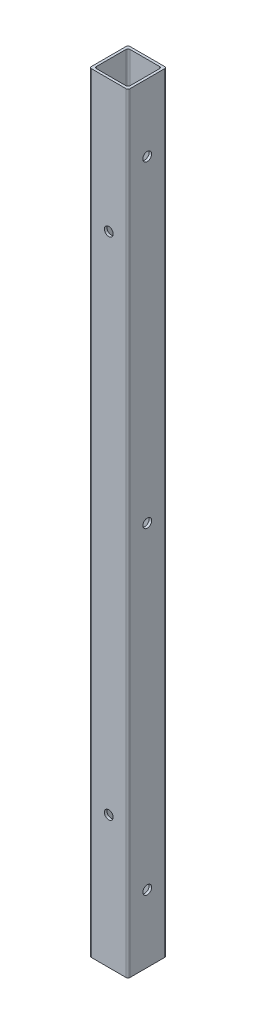
ISO-10303-21;
HEADER;
FILE_DESCRIPTION(('STEP AP214'),'2;1');
FILE_NAME('part.step','',(''),(''),'','','');
FILE_SCHEMA(('AUTOMOTIVE_DESIGN { 1 0 10303 214 1 1 1 1 }'));
ENDSEC;
DATA;
#1=APPLICATION_CONTEXT('core data for automotive mechanical design processes');
#2=APPLICATION_PROTOCOL_DEFINITION('international standard','automotive_design',2000,#1);
#3=PRODUCT_CONTEXT('',#1,'mechanical');
#4=PRODUCT('Part','Part','',(#3));
#5=PRODUCT_RELATED_PRODUCT_CATEGORY('part','',(#4));
#6=PRODUCT_DEFINITION_FORMATION('','',#4);
#7=PRODUCT_DEFINITION_CONTEXT('part definition',#1,'design');
#8=PRODUCT_DEFINITION('design','',#6,#7);
#9=PRODUCT_DEFINITION_SHAPE('','',#8);
#10=(LENGTH_UNIT() NAMED_UNIT(*) SI_UNIT(.MILLI.,.METRE.));
#11=(NAMED_UNIT(*) PLANE_ANGLE_UNIT() SI_UNIT($,.RADIAN.));
#12=(NAMED_UNIT(*) SI_UNIT($,.STERADIAN.) SOLID_ANGLE_UNIT());
#13=UNCERTAINTY_MEASURE_WITH_UNIT(LENGTH_MEASURE(1.E-05),#10,'distance_accuracy_value','');
#14=(GEOMETRIC_REPRESENTATION_CONTEXT(3) GLOBAL_UNCERTAINTY_ASSIGNED_CONTEXT((#13)) GLOBAL_UNIT_ASSIGNED_CONTEXT((#10,
#11,#12)) REPRESENTATION_CONTEXT('',''));
#15=CARTESIAN_POINT('',(0.,0.,0.));
#16=DIRECTION('',(0.,0.,1.));
#17=DIRECTION('',(1.,0.,0.));
#18=AXIS2_PLACEMENT_3D('',#15,#16,#17);
#19=CARTESIAN_POINT('',(0.,508.,0.));
#20=DIRECTION('',(0.,-1.,0.));
#21=DIRECTION('',(0.,0.,-1.));
#22=AXIS2_PLACEMENT_3D('',#19,#20,#21);
#23=PLANE('',#22);
#24=DIRECTION('',(0.,0.,1.));
#25=VECTOR('',#24,1.);
#26=CARTESIAN_POINT('',(-12.7,508.,12.7));
#27=LINE('',#26,#25);
#28=CARTESIAN_POINT('',(-12.7,508.,-11.43));
#29=VERTEX_POINT('',#28);
#30=CARTESIAN_POINT('',(-12.7,508.,11.43));
#31=VERTEX_POINT('',#30);
#32=EDGE_CURVE('E180',#29,#31,#27,.T.);
#33=ORIENTED_EDGE('',*,*,#32,.T.);
#34=CARTESIAN_POINT('',(-11.43,508.,11.43));
#35=DIRECTION('',(0.,-1.,0.));
#36=DIRECTION('',(0.,0.,-1.));
#37=AXIS2_PLACEMENT_3D('',#34,#35,#36);
#38=CIRCLE('',#37,1.27);
#39=CARTESIAN_POINT('',(-11.43,508.,12.7));
#40=VERTEX_POINT('',#39);
#41=EDGE_CURVE('E222',#31,#40,#38,.F.);
#42=ORIENTED_EDGE('',*,*,#41,.T.);
#43=DIRECTION('',(1.,0.,0.));
#44=VECTOR('',#43,1.);
#45=CARTESIAN_POINT('',(-12.7,508.,12.7));
#46=LINE('',#45,#44);
#47=CARTESIAN_POINT('',(11.43,508.,12.7));
#48=VERTEX_POINT('',#47);
#49=EDGE_CURVE('E175',#40,#48,#46,.T.);
#50=ORIENTED_EDGE('',*,*,#49,.T.);
#51=CARTESIAN_POINT('',(11.43,508.,11.43));
#52=DIRECTION('',(0.,-1.,0.));
#53=DIRECTION('',(0.,0.,-1.));
#54=AXIS2_PLACEMENT_3D('',#51,#52,#53);
#55=CIRCLE('',#54,1.27);
#56=CARTESIAN_POINT('',(12.7,508.,11.43));
#57=VERTEX_POINT('',#56);
#58=EDGE_CURVE('E217',#48,#57,#55,.F.);
#59=ORIENTED_EDGE('',*,*,#58,.T.);
#60=DIRECTION('',(0.,0.,-1.));
#61=VECTOR('',#60,1.);
#62=CARTESIAN_POINT('',(12.7,508.,12.7));
#63=LINE('',#62,#61);
#64=CARTESIAN_POINT('',(12.7,508.,-11.43));
#65=VERTEX_POINT('',#64);
#66=EDGE_CURVE('E301',#57,#65,#63,.T.);
#67=ORIENTED_EDGE('',*,*,#66,.T.);
#68=CARTESIAN_POINT('',(11.43,508.,-11.43));
#69=DIRECTION('',(0.,-1.,0.));
#70=DIRECTION('',(0.,0.,-1.));
#71=AXIS2_PLACEMENT_3D('',#68,#69,#70);
#72=CIRCLE('',#71,1.27);
#73=CARTESIAN_POINT('',(11.43,508.,-12.7));
#74=VERTEX_POINT('',#73);
#75=EDGE_CURVE('E58',#65,#74,#72,.F.);
#76=ORIENTED_EDGE('',*,*,#75,.T.);
#77=DIRECTION('',(-1.,0.,0.));
#78=VECTOR('',#77,1.);
#79=CARTESIAN_POINT('',(-12.7,508.,-12.7));
#80=LINE('',#79,#78);
#81=CARTESIAN_POINT('',(-11.43,508.,-12.7));
#82=VERTEX_POINT('',#81);
#83=EDGE_CURVE('E303',#74,#82,#80,.T.);
#84=ORIENTED_EDGE('',*,*,#83,.T.);
#85=CARTESIAN_POINT('',(-11.43,508.,-11.43));
#86=DIRECTION('',(0.,-1.,0.));
#87=DIRECTION('',(0.,0.,-1.));
#88=AXIS2_PLACEMENT_3D('',#85,#86,#87);
#89=CIRCLE('',#88,1.27);
#90=EDGE_CURVE('E220',#82,#29,#89,.F.);
#91=ORIENTED_EDGE('',*,*,#90,.T.);
#92=EDGE_LOOP('',(#33,#42,#50,#59,#67,#76,#84,#91));
#93=FACE_BOUND('',#92,.T.);
#94=DIRECTION('',(1.,0.,0.));
#95=VECTOR('',#94,1.);
#96=CARTESIAN_POINT('',(-11.049,508.,11.049));
#97=LINE('',#96,#95);
#98=CARTESIAN_POINT('',(-9.779,508.,11.049));
#99=VERTEX_POINT('',#98);
#100=CARTESIAN_POINT('',(9.779,508.,11.049));
#101=VERTEX_POINT('',#100);
#102=EDGE_CURVE('E284',#99,#101,#97,.T.);
#103=ORIENTED_EDGE('',*,*,#102,.F.);
#104=CARTESIAN_POINT('',(-9.779,508.,9.779));
#105=DIRECTION('',(0.,-1.,0.));
#106=DIRECTION('',(0.,0.,-1.));
#107=AXIS2_PLACEMENT_3D('',#104,#105,#106);
#108=CIRCLE('',#107,1.27);
#109=CARTESIAN_POINT('',(-11.049,508.,9.779));
#110=VERTEX_POINT('',#109);
#111=EDGE_CURVE('E11',#99,#110,#108,.T.);
#112=ORIENTED_EDGE('',*,*,#111,.T.);
#113=DIRECTION('',(0.,0.,1.));
#114=VECTOR('',#113,1.);
#115=CARTESIAN_POINT('',(-11.049,508.,11.049));
#116=LINE('',#115,#114);
#117=CARTESIAN_POINT('',(-11.049,508.,-9.779));
#118=VERTEX_POINT('',#117);
#119=EDGE_CURVE('E292',#118,#110,#116,.T.);
#120=ORIENTED_EDGE('',*,*,#119,.F.);
#121=CARTESIAN_POINT('',(-9.779,508.,-9.779));
#122=DIRECTION('',(0.,-1.,0.));
#123=DIRECTION('',(0.,0.,-1.));
#124=AXIS2_PLACEMENT_3D('',#121,#122,#123);
#125=CIRCLE('',#124,1.27);
#126=CARTESIAN_POINT('',(-9.779,508.,-11.049));
#127=VERTEX_POINT('',#126);
#128=EDGE_CURVE('E235',#118,#127,#125,.T.);
#129=ORIENTED_EDGE('',*,*,#128,.T.);
#130=DIRECTION('',(-1.,0.,0.));
#131=VECTOR('',#130,1.);
#132=CARTESIAN_POINT('',(-11.049,508.,-11.049));
#133=LINE('',#132,#131);
#134=CARTESIAN_POINT('',(9.779,508.,-11.049));
#135=VERTEX_POINT('',#134);
#136=EDGE_CURVE('E290',#135,#127,#133,.T.);
#137=ORIENTED_EDGE('',*,*,#136,.F.);
#138=CARTESIAN_POINT('',(9.779,508.,-9.779));
#139=DIRECTION('',(0.,-1.,0.));
#140=DIRECTION('',(0.,0.,-1.));
#141=AXIS2_PLACEMENT_3D('',#138,#139,#140);
#142=CIRCLE('',#141,1.27);
#143=CARTESIAN_POINT('',(11.049,508.,-9.779));
#144=VERTEX_POINT('',#143);
#145=EDGE_CURVE('E160',#135,#144,#142,.T.);
#146=ORIENTED_EDGE('',*,*,#145,.T.);
#147=DIRECTION('',(0.,0.,-1.));
#148=VECTOR('',#147,1.);
#149=CARTESIAN_POINT('',(11.049,508.,11.049));
#150=LINE('',#149,#148);
#151=CARTESIAN_POINT('',(11.049,508.,9.779));
#152=VERTEX_POINT('',#151);
#153=EDGE_CURVE('E287',#152,#144,#150,.T.);
#154=ORIENTED_EDGE('',*,*,#153,.F.);
#155=CARTESIAN_POINT('',(9.779,508.,9.779));
#156=DIRECTION('',(0.,-1.,0.));
#157=DIRECTION('',(0.,0.,-1.));
#158=AXIS2_PLACEMENT_3D('',#155,#156,#157);
#159=CIRCLE('',#158,1.27);
#160=EDGE_CURVE('E161',#152,#101,#159,.T.);
#161=ORIENTED_EDGE('',*,*,#160,.T.);
#162=EDGE_LOOP('',(#103,#112,#120,#129,#137,#146,#154,#161));
#163=FACE_BOUND('',#162,.T.);
#164=ADVANCED_FACE('F34',(#93,#163),#23,.F.);
#165=CARTESIAN_POINT('',(0.,0.,0.));
#166=DIRECTION('',(0.,-1.,0.));
#167=DIRECTION('',(0.,0.,-1.));
#168=AXIS2_PLACEMENT_3D('',#165,#166,#167);
#169=PLANE('',#168);
#170=DIRECTION('',(1.,0.,0.));
#171=VECTOR('',#170,1.);
#172=CARTESIAN_POINT('',(-12.7,0.,12.7));
#173=LINE('',#172,#171);
#174=CARTESIAN_POINT('',(-11.43,0.,12.7));
#175=VERTEX_POINT('',#174);
#176=CARTESIAN_POINT('',(11.43,0.,12.7));
#177=VERTEX_POINT('',#176);
#178=EDGE_CURVE('E183',#175,#177,#173,.T.);
#179=ORIENTED_EDGE('',*,*,#178,.F.);
#180=CARTESIAN_POINT('',(-11.43,0.,11.43));
#181=DIRECTION('',(0.,-1.,0.));
#182=DIRECTION('',(0.,0.,-1.));
#183=AXIS2_PLACEMENT_3D('',#180,#181,#182);
#184=CIRCLE('',#183,1.27);
#185=CARTESIAN_POINT('',(-12.7,0.,11.43));
#186=VERTEX_POINT('',#185);
#187=EDGE_CURVE('E210',#175,#186,#184,.T.);
#188=ORIENTED_EDGE('',*,*,#187,.T.);
#189=DIRECTION('',(0.,0.,1.));
#190=VECTOR('',#189,1.);
#191=CARTESIAN_POINT('',(-12.7,0.,12.7));
#192=LINE('',#191,#190);
#193=CARTESIAN_POINT('',(-12.7,0.,-11.43));
#194=VERTEX_POINT('',#193);
#195=EDGE_CURVE('E310',#194,#186,#192,.T.);
#196=ORIENTED_EDGE('',*,*,#195,.F.);
#197=CARTESIAN_POINT('',(-11.43,0.,-11.43));
#198=DIRECTION('',(0.,-1.,0.));
#199=DIRECTION('',(0.,0.,-1.));
#200=AXIS2_PLACEMENT_3D('',#197,#198,#199);
#201=CIRCLE('',#200,1.27);
#202=CARTESIAN_POINT('',(-11.43,0.,-12.7));
#203=VERTEX_POINT('',#202);
#204=EDGE_CURVE('E208',#194,#203,#201,.T.);
#205=ORIENTED_EDGE('',*,*,#204,.T.);
#206=DIRECTION('',(-1.,0.,0.));
#207=VECTOR('',#206,1.);
#208=CARTESIAN_POINT('',(-12.7,0.,-12.7));
#209=LINE('',#208,#207);
#210=CARTESIAN_POINT('',(11.43,0.,-12.7));
#211=VERTEX_POINT('',#210);
#212=EDGE_CURVE('E309',#211,#203,#209,.T.);
#213=ORIENTED_EDGE('',*,*,#212,.F.);
#214=CARTESIAN_POINT('',(11.43,0.,-11.43));
#215=DIRECTION('',(0.,-1.,0.));
#216=DIRECTION('',(0.,0.,-1.));
#217=AXIS2_PLACEMENT_3D('',#214,#215,#216);
#218=CIRCLE('',#217,1.27);
#219=CARTESIAN_POINT('',(12.7,0.,-11.43));
#220=VERTEX_POINT('',#219);
#221=EDGE_CURVE('E206',#211,#220,#218,.T.);
#222=ORIENTED_EDGE('',*,*,#221,.T.);
#223=DIRECTION('',(0.,0.,-1.));
#224=VECTOR('',#223,1.);
#225=CARTESIAN_POINT('',(12.7,0.,12.7));
#226=LINE('',#225,#224);
#227=CARTESIAN_POINT('',(12.7,0.,11.43));
#228=VERTEX_POINT('',#227);
#229=EDGE_CURVE('E295',#228,#220,#226,.T.);
#230=ORIENTED_EDGE('',*,*,#229,.F.);
#231=CARTESIAN_POINT('',(11.43,0.,11.43));
#232=DIRECTION('',(0.,-1.,0.));
#233=DIRECTION('',(0.,0.,-1.));
#234=AXIS2_PLACEMENT_3D('',#231,#232,#233);
#235=CIRCLE('',#234,1.27);
#236=EDGE_CURVE('E204',#228,#177,#235,.T.);
#237=ORIENTED_EDGE('',*,*,#236,.T.);
#238=EDGE_LOOP('',(#179,#188,#196,#205,#213,#222,#230,#237));
#239=FACE_BOUND('',#238,.T.);
#240=DIRECTION('',(-1.,0.,0.));
#241=VECTOR('',#240,1.);
#242=CARTESIAN_POINT('',(-11.049,0.,-11.049));
#243=LINE('',#242,#241);
#244=CARTESIAN_POINT('',(9.779,0.,-11.049));
#245=VERTEX_POINT('',#244);
#246=CARTESIAN_POINT('',(-9.779,0.,-11.049));
#247=VERTEX_POINT('',#246);
#248=EDGE_CURVE('E153',#245,#247,#243,.T.);
#249=ORIENTED_EDGE('',*,*,#248,.T.);
#250=CARTESIAN_POINT('',(-9.779,0.,-9.779));
#251=DIRECTION('',(0.,-1.,0.));
#252=DIRECTION('',(0.,0.,-1.));
#253=AXIS2_PLACEMENT_3D('',#250,#251,#252);
#254=CIRCLE('',#253,1.27);
#255=CARTESIAN_POINT('',(-11.049,0.,-9.779));
#256=VERTEX_POINT('',#255);
#257=EDGE_CURVE('E233',#247,#256,#254,.F.);
#258=ORIENTED_EDGE('',*,*,#257,.T.);
#259=DIRECTION('',(0.,0.,1.));
#260=VECTOR('',#259,1.);
#261=CARTESIAN_POINT('',(-11.049,0.,11.049));
#262=LINE('',#261,#260);
#263=CARTESIAN_POINT('',(-11.049,0.,9.779));
#264=VERTEX_POINT('',#263);
#265=EDGE_CURVE('E171',#256,#264,#262,.T.);
#266=ORIENTED_EDGE('',*,*,#265,.T.);
#267=CARTESIAN_POINT('',(-9.779,0.,9.779));
#268=DIRECTION('',(0.,-1.,0.));
#269=DIRECTION('',(0.,0.,-1.));
#270=AXIS2_PLACEMENT_3D('',#267,#268,#269);
#271=CIRCLE('',#270,1.27);
#272=CARTESIAN_POINT('',(-9.779,0.,11.049));
#273=VERTEX_POINT('',#272);
#274=EDGE_CURVE('E43',#264,#273,#271,.F.);
#275=ORIENTED_EDGE('',*,*,#274,.T.);
#276=DIRECTION('',(1.,0.,0.));
#277=VECTOR('',#276,1.);
#278=CARTESIAN_POINT('',(-11.049,0.,11.049));
#279=LINE('',#278,#277);
#280=CARTESIAN_POINT('',(9.779,0.,11.049));
#281=VERTEX_POINT('',#280);
#282=EDGE_CURVE('E283',#273,#281,#279,.T.);
#283=ORIENTED_EDGE('',*,*,#282,.T.);
#284=CARTESIAN_POINT('',(9.779,0.,9.779));
#285=DIRECTION('',(0.,-1.,0.));
#286=DIRECTION('',(0.,0.,-1.));
#287=AXIS2_PLACEMENT_3D('',#284,#285,#286);
#288=CIRCLE('',#287,1.27);
#289=CARTESIAN_POINT('',(11.049,0.,9.779));
#290=VERTEX_POINT('',#289);
#291=EDGE_CURVE('E237',#281,#290,#288,.F.);
#292=ORIENTED_EDGE('',*,*,#291,.T.);
#293=DIRECTION('',(0.,0.,-1.));
#294=VECTOR('',#293,1.);
#295=CARTESIAN_POINT('',(11.049,0.,11.049));
#296=LINE('',#295,#294);
#297=CARTESIAN_POINT('',(11.049,0.,-9.779));
#298=VERTEX_POINT('',#297);
#299=EDGE_CURVE('E155',#290,#298,#296,.T.);
#300=ORIENTED_EDGE('',*,*,#299,.T.);
#301=CARTESIAN_POINT('',(9.779,0.,-9.779));
#302=DIRECTION('',(0.,-1.,0.));
#303=DIRECTION('',(0.,0.,-1.));
#304=AXIS2_PLACEMENT_3D('',#301,#302,#303);
#305=CIRCLE('',#304,1.27);
#306=EDGE_CURVE('E150',#298,#245,#305,.F.);
#307=ORIENTED_EDGE('',*,*,#306,.T.);
#308=EDGE_LOOP('',(#249,#258,#266,#275,#283,#292,#300,#307));
#309=FACE_BOUND('',#308,.T.);
#310=ADVANCED_FACE('F152',(#239,#309),#169,.T.);
#311=CARTESIAN_POINT('',(12.7,508.,12.7));
#312=DIRECTION('',(-1.,0.,0.));
#313=DIRECTION('',(0.,0.,1.));
#314=AXIS2_PLACEMENT_3D('',#311,#312,#313);
#315=PLANE('',#314);
#316=CARTESIAN_POINT('',(12.7,44.45,0.));
#317=DIRECTION('',(-1.,0.,0.));
#318=DIRECTION('',(0.,0.,1.));
#319=AXIS2_PLACEMENT_3D('',#316,#317,#318);
#320=CIRCLE('',#319,2.8956);
#321=CARTESIAN_POINT('',(12.7,44.45,2.8956));
#322=VERTEX_POINT('',#321);
#323=EDGE_CURVE('E254',#322,#322,#320,.T.);
#324=ORIENTED_EDGE('',*,*,#323,.T.);
#325=EDGE_LOOP('',(#324));
#326=FACE_BOUND('',#325,.T.);
#327=CARTESIAN_POINT('',(12.7,254.,0.));
#328=DIRECTION('',(-1.,0.,0.));
#329=DIRECTION('',(0.,0.,1.));
#330=AXIS2_PLACEMENT_3D('',#327,#328,#329);
#331=CIRCLE('',#330,2.8956);
#332=CARTESIAN_POINT('',(12.7,254.,2.8956));
#333=VERTEX_POINT('',#332);
#334=EDGE_CURVE('E250',#333,#333,#331,.T.);
#335=ORIENTED_EDGE('',*,*,#334,.T.);
#336=EDGE_LOOP('',(#335));
#337=FACE_BOUND('',#336,.T.);
#338=CARTESIAN_POINT('',(12.7,463.55,0.));
#339=DIRECTION('',(-1.,0.,0.));
#340=DIRECTION('',(0.,0.,1.));
#341=AXIS2_PLACEMENT_3D('',#338,#339,#340);
#342=CIRCLE('',#341,2.8956);
#343=CARTESIAN_POINT('',(12.7,463.55,2.8956));
#344=VERTEX_POINT('',#343);
#345=EDGE_CURVE('E246',#344,#344,#342,.T.);
#346=ORIENTED_EDGE('',*,*,#345,.T.);
#347=EDGE_LOOP('',(#346));
#348=FACE_BOUND('',#347,.T.);
#349=ORIENTED_EDGE('',*,*,#229,.T.);
#350=DIRECTION('',(0.,-1.,0.));
#351=VECTOR('',#350,1.);
#352=CARTESIAN_POINT('',(12.7,508.,-11.43));
#353=LINE('',#352,#351);
#354=EDGE_CURVE('E231',#220,#65,#353,.F.);
#355=ORIENTED_EDGE('',*,*,#354,.T.);
#356=ORIENTED_EDGE('',*,*,#66,.F.);
#357=DIRECTION('',(0.,-1.,0.));
#358=VECTOR('',#357,1.);
#359=CARTESIAN_POINT('',(12.7,508.,11.43));
#360=LINE('',#359,#358);
#361=EDGE_CURVE('E228',#57,#228,#360,.T.);
#362=ORIENTED_EDGE('',*,*,#361,.T.);
#363=EDGE_LOOP('',(#349,#355,#356,#362));
#364=FACE_BOUND('',#363,.T.);
#365=ADVANCED_FACE('F329',(#326,#337,#348,#364),#315,.F.);
#366=CARTESIAN_POINT('',(-12.7,508.,-12.7));
#367=DIRECTION('',(0.,0.,1.));
#368=DIRECTION('',(1.,0.,0.));
#369=AXIS2_PLACEMENT_3D('',#366,#367,#368);
#370=PLANE('',#369);
#371=CARTESIAN_POINT('',(0.,87.3125,-12.7));
#372=DIRECTION('',(0.,0.,-1.));
#373=DIRECTION('',(-1.,0.,0.));
#374=AXIS2_PLACEMENT_3D('',#371,#372,#373);
#375=CIRCLE('',#374,2.89559999999999);
#376=CARTESIAN_POINT('',(-2.89560000000004,87.3125,-12.7));
#377=VERTEX_POINT('',#376);
#378=EDGE_CURVE('E690',#377,#377,#375,.T.);
#379=ORIENTED_EDGE('',*,*,#378,.F.);
#380=EDGE_LOOP('',(#379));
#381=FACE_BOUND('',#380,.T.);
#382=CARTESIAN_POINT('',(0.,420.6875,-12.7));
#383=DIRECTION('',(0.,0.,-1.));
#384=DIRECTION('',(-1.,0.,0.));
#385=AXIS2_PLACEMENT_3D('',#382,#383,#384);
#386=CIRCLE('',#385,2.89559999999999);
#387=CARTESIAN_POINT('',(-2.8956,420.6875,-12.7));
#388=VERTEX_POINT('',#387);
#389=EDGE_CURVE('E683',#388,#388,#386,.T.);
#390=ORIENTED_EDGE('',*,*,#389,.F.);
#391=EDGE_LOOP('',(#390));
#392=FACE_BOUND('',#391,.T.);
#393=ORIENTED_EDGE('',*,*,#212,.T.);
#394=DIRECTION('',(0.,-1.,0.));
#395=VECTOR('',#394,1.);
#396=CARTESIAN_POINT('',(-11.43,508.,-12.7));
#397=LINE('',#396,#395);
#398=EDGE_CURVE('E51',#203,#82,#397,.F.);
#399=ORIENTED_EDGE('',*,*,#398,.T.);
#400=ORIENTED_EDGE('',*,*,#83,.F.);
#401=DIRECTION('',(0.,-1.,0.));
#402=VECTOR('',#401,1.);
#403=CARTESIAN_POINT('',(11.43,508.,-12.7));
#404=LINE('',#403,#402);
#405=EDGE_CURVE('E224',#74,#211,#404,.T.);
#406=ORIENTED_EDGE('',*,*,#405,.T.);
#407=EDGE_LOOP('',(#393,#399,#400,#406));
#408=FACE_BOUND('',#407,.T.);
#409=ADVANCED_FACE('F336',(#381,#392,#408),#370,.F.);
#410=CARTESIAN_POINT('',(-12.7,508.,12.7));
#411=DIRECTION('',(1.,0.,0.));
#412=DIRECTION('',(0.,0.,-1.));
#413=AXIS2_PLACEMENT_3D('',#410,#411,#412);
#414=PLANE('',#413);
#415=CARTESIAN_POINT('',(-12.7,44.45,0.));
#416=DIRECTION('',(-1.,0.,0.));
#417=DIRECTION('',(0.,0.,1.));
#418=AXIS2_PLACEMENT_3D('',#415,#416,#417);
#419=CIRCLE('',#418,2.89559999999998);
#420=CARTESIAN_POINT('',(-12.7,44.45,2.89559999999998));
#421=VERTEX_POINT('',#420);
#422=EDGE_CURVE('E261',#421,#421,#419,.T.);
#423=ORIENTED_EDGE('',*,*,#422,.F.);
#424=EDGE_LOOP('',(#423));
#425=FACE_BOUND('',#424,.T.);
#426=CARTESIAN_POINT('',(-12.7,254.,0.));
#427=DIRECTION('',(-1.,0.,0.));
#428=DIRECTION('',(0.,0.,1.));
#429=AXIS2_PLACEMENT_3D('',#426,#427,#428);
#430=CIRCLE('',#429,2.8956);
#431=CARTESIAN_POINT('',(-12.7,254.,2.8956));
#432=VERTEX_POINT('',#431);
#433=EDGE_CURVE('E258',#432,#432,#430,.T.);
#434=ORIENTED_EDGE('',*,*,#433,.F.);
#435=EDGE_LOOP('',(#434));
#436=FACE_BOUND('',#435,.T.);
#437=CARTESIAN_POINT('',(-12.7,463.55,0.));
#438=DIRECTION('',(-1.,0.,0.));
#439=DIRECTION('',(0.,0.,1.));
#440=AXIS2_PLACEMENT_3D('',#437,#438,#439);
#441=CIRCLE('',#440,2.8956);
#442=CARTESIAN_POINT('',(-12.7,463.55,2.8956));
#443=VERTEX_POINT('',#442);
#444=EDGE_CURVE('E276',#443,#443,#441,.T.);
#445=ORIENTED_EDGE('',*,*,#444,.F.);
#446=EDGE_LOOP('',(#445));
#447=FACE_BOUND('',#446,.T.);
#448=ORIENTED_EDGE('',*,*,#195,.T.);
#449=DIRECTION('',(0.,-1.,0.));
#450=VECTOR('',#449,1.);
#451=CARTESIAN_POINT('',(-12.7,508.,11.43));
#452=LINE('',#451,#450);
#453=EDGE_CURVE('E215',#186,#31,#452,.F.);
#454=ORIENTED_EDGE('',*,*,#453,.T.);
#455=ORIENTED_EDGE('',*,*,#32,.F.);
#456=DIRECTION('',(0.,-1.,0.));
#457=VECTOR('',#456,1.);
#458=CARTESIAN_POINT('',(-12.7,508.,-11.43));
#459=LINE('',#458,#457);
#460=EDGE_CURVE('E212',#29,#194,#459,.T.);
#461=ORIENTED_EDGE('',*,*,#460,.T.);
#462=EDGE_LOOP('',(#448,#454,#455,#461));
#463=FACE_BOUND('',#462,.T.);
#464=ADVANCED_FACE('F342',(#425,#436,#447,#463),#414,.F.);
#465=CARTESIAN_POINT('',(-12.7,508.,12.7));
#466=DIRECTION('',(0.,0.,-1.));
#467=DIRECTION('',(-1.,0.,0.));
#468=AXIS2_PLACEMENT_3D('',#465,#466,#467);
#469=PLANE('',#468);
#470=CARTESIAN_POINT('',(0.,87.3125,12.7));
#471=DIRECTION('',(0.,0.,-1.));
#472=DIRECTION('',(-1.,0.,0.));
#473=AXIS2_PLACEMENT_3D('',#470,#471,#472);
#474=CIRCLE('',#473,2.89559999999999);
#475=CARTESIAN_POINT('',(-2.89560000000005,87.3125,12.7));
#476=VERTEX_POINT('',#475);
#477=EDGE_CURVE('E687',#476,#476,#474,.T.);
#478=ORIENTED_EDGE('',*,*,#477,.T.);
#479=EDGE_LOOP('',(#478));
#480=FACE_BOUND('',#479,.T.);
#481=CARTESIAN_POINT('',(0.,420.6875,12.7));
#482=DIRECTION('',(0.,0.,-1.));
#483=DIRECTION('',(-1.,0.,0.));
#484=AXIS2_PLACEMENT_3D('',#481,#482,#483);
#485=CIRCLE('',#484,2.89559999999999);
#486=CARTESIAN_POINT('',(-2.89560000000001,420.6875,12.7));
#487=VERTEX_POINT('',#486);
#488=EDGE_CURVE('E678',#487,#487,#485,.T.);
#489=ORIENTED_EDGE('',*,*,#488,.T.);
#490=EDGE_LOOP('',(#489));
#491=FACE_BOUND('',#490,.T.);
#492=ORIENTED_EDGE('',*,*,#49,.F.);
#493=DIRECTION('',(0.,-1.,0.));
#494=VECTOR('',#493,1.);
#495=CARTESIAN_POINT('',(-11.43,508.,12.7));
#496=LINE('',#495,#494);
#497=EDGE_CURVE('E201',#40,#175,#496,.T.);
#498=ORIENTED_EDGE('',*,*,#497,.T.);
#499=ORIENTED_EDGE('',*,*,#178,.T.);
#500=DIRECTION('',(0.,-1.,0.));
#501=VECTOR('',#500,1.);
#502=CARTESIAN_POINT('',(11.43,508.,12.7));
#503=LINE('',#502,#501);
#504=EDGE_CURVE('E199',#177,#48,#503,.F.);
#505=ORIENTED_EDGE('',*,*,#504,.T.);
#506=EDGE_LOOP('',(#492,#498,#499,#505));
#507=FACE_BOUND('',#506,.T.);
#508=ADVANCED_FACE('F320',(#480,#491,#507),#469,.F.);
#509=CARTESIAN_POINT('',(-11.049,508.,11.049));
#510=DIRECTION('',(0.,0.,-1.));
#511=DIRECTION('',(-1.,0.,0.));
#512=AXIS2_PLACEMENT_3D('',#509,#510,#511);
#513=PLANE('',#512);
#514=CARTESIAN_POINT('',(0.,87.3125,11.049));
#515=DIRECTION('',(0.,0.,-1.));
#516=DIRECTION('',(-1.,0.,0.));
#517=AXIS2_PLACEMENT_3D('',#514,#515,#516);
#518=CIRCLE('',#517,2.89559999999999);
#519=CARTESIAN_POINT('',(-2.89560000000004,87.3125,11.049));
#520=VERTEX_POINT('',#519);
#521=EDGE_CURVE('E657',#520,#520,#518,.T.);
#522=ORIENTED_EDGE('',*,*,#521,.F.);
#523=EDGE_LOOP('',(#522));
#524=FACE_BOUND('',#523,.T.);
#525=CARTESIAN_POINT('',(0.,420.6875,11.049));
#526=DIRECTION('',(0.,0.,-1.));
#527=DIRECTION('',(-1.,0.,0.));
#528=AXIS2_PLACEMENT_3D('',#525,#526,#527);
#529=CIRCLE('',#528,2.89559999999999);
#530=CARTESIAN_POINT('',(-2.8956,420.6875,11.049));
#531=VERTEX_POINT('',#530);
#532=EDGE_CURVE('E266',#531,#531,#529,.T.);
#533=ORIENTED_EDGE('',*,*,#532,.F.);
#534=EDGE_LOOP('',(#533));
#535=FACE_BOUND('',#534,.T.);
#536=ORIENTED_EDGE('',*,*,#102,.T.);
#537=DIRECTION('',(0.,-1.,0.));
#538=VECTOR('',#537,1.);
#539=CARTESIAN_POINT('',(9.779,0.,11.049));
#540=LINE('',#539,#538);
#541=EDGE_CURVE('E192',#101,#281,#540,.T.);
#542=ORIENTED_EDGE('',*,*,#541,.T.);
#543=ORIENTED_EDGE('',*,*,#282,.F.);
#544=DIRECTION('',(0.,-1.,0.));
#545=VECTOR('',#544,1.);
#546=CARTESIAN_POINT('',(-9.779,508.,11.049));
#547=LINE('',#546,#545);
#548=EDGE_CURVE('E190',#273,#99,#547,.F.);
#549=ORIENTED_EDGE('',*,*,#548,.T.);
#550=EDGE_LOOP('',(#536,#542,#543,#549));
#551=FACE_BOUND('',#550,.T.);
#552=ADVANCED_FACE('F363',(#524,#535,#551),#513,.T.);
#553=CARTESIAN_POINT('',(11.049,508.,11.049));
#554=DIRECTION('',(-1.,0.,0.));
#555=DIRECTION('',(0.,0.,1.));
#556=AXIS2_PLACEMENT_3D('',#553,#554,#555);
#557=PLANE('',#556);
#558=CARTESIAN_POINT('',(11.049,44.45,0.));
#559=DIRECTION('',(-1.,0.,0.));
#560=DIRECTION('',(0.,0.,1.));
#561=AXIS2_PLACEMENT_3D('',#558,#559,#560);
#562=CIRCLE('',#561,2.89559999999999);
#563=CARTESIAN_POINT('',(11.049,44.45,2.89559999999999));
#564=VERTEX_POINT('',#563);
#565=EDGE_CURVE('E253',#564,#564,#562,.T.);
#566=ORIENTED_EDGE('',*,*,#565,.F.);
#567=EDGE_LOOP('',(#566));
#568=FACE_BOUND('',#567,.T.);
#569=CARTESIAN_POINT('',(11.049,254.,0.));
#570=DIRECTION('',(-1.,0.,0.));
#571=DIRECTION('',(0.,0.,1.));
#572=AXIS2_PLACEMENT_3D('',#569,#570,#571);
#573=CIRCLE('',#572,2.8956);
#574=CARTESIAN_POINT('',(11.049,254.,2.8956));
#575=VERTEX_POINT('',#574);
#576=EDGE_CURVE('E249',#575,#575,#573,.T.);
#577=ORIENTED_EDGE('',*,*,#576,.F.);
#578=EDGE_LOOP('',(#577));
#579=FACE_BOUND('',#578,.T.);
#580=CARTESIAN_POINT('',(11.049,463.55,0.));
#581=DIRECTION('',(-1.,0.,0.));
#582=DIRECTION('',(0.,0.,1.));
#583=AXIS2_PLACEMENT_3D('',#580,#581,#582);
#584=CIRCLE('',#583,2.8956);
#585=CARTESIAN_POINT('',(11.049,463.55,2.8956));
#586=VERTEX_POINT('',#585);
#587=EDGE_CURVE('E245',#586,#586,#584,.T.);
#588=ORIENTED_EDGE('',*,*,#587,.F.);
#589=EDGE_LOOP('',(#588));
#590=FACE_BOUND('',#589,.T.);
#591=ORIENTED_EDGE('',*,*,#299,.F.);
#592=DIRECTION('',(0.,-1.,0.));
#593=VECTOR('',#592,1.);
#594=CARTESIAN_POINT('',(11.049,508.,9.779));
#595=LINE('',#594,#593);
#596=EDGE_CURVE('E197',#290,#152,#595,.F.);
#597=ORIENTED_EDGE('',*,*,#596,.T.);
#598=ORIENTED_EDGE('',*,*,#153,.T.);
#599=DIRECTION('',(0.,-1.,0.));
#600=VECTOR('',#599,1.);
#601=CARTESIAN_POINT('',(11.049,0.,-9.779));
#602=LINE('',#601,#600);
#603=EDGE_CURVE('E195',#144,#298,#602,.T.);
#604=ORIENTED_EDGE('',*,*,#603,.T.);
#605=EDGE_LOOP('',(#591,#597,#598,#604));
#606=FACE_BOUND('',#605,.T.);
#607=ADVANCED_FACE('F461',(#568,#579,#590,#606),#557,.T.);
#608=CARTESIAN_POINT('',(-11.049,508.,-11.049));
#609=DIRECTION('',(0.,0.,1.));
#610=DIRECTION('',(1.,0.,0.));
#611=AXIS2_PLACEMENT_3D('',#608,#609,#610);
#612=PLANE('',#611);
#613=CARTESIAN_POINT('',(0.,87.3125,-11.049));
#614=DIRECTION('',(0.,0.,1.));
#615=DIRECTION('',(1.,0.,0.));
#616=AXIS2_PLACEMENT_3D('',#613,#614,#615);
#617=CIRCLE('',#616,2.89559999999999);
#618=CARTESIAN_POINT('',(2.89559999999994,87.3125,-11.049));
#619=VERTEX_POINT('',#618);
#620=EDGE_CURVE('E38',#619,#619,#617,.T.);
#621=ORIENTED_EDGE('',*,*,#620,.F.);
#622=EDGE_LOOP('',(#621));
#623=FACE_BOUND('',#622,.T.);
#624=CARTESIAN_POINT('',(0.,420.6875,-11.049));
#625=DIRECTION('',(0.,0.,1.));
#626=DIRECTION('',(1.,0.,0.));
#627=AXIS2_PLACEMENT_3D('',#624,#625,#626);
#628=CIRCLE('',#627,2.89559999999999);
#629=CARTESIAN_POINT('',(2.89559999999998,420.6875,-11.049));
#630=VERTEX_POINT('',#629);
#631=EDGE_CURVE('E676',#630,#630,#628,.T.);
#632=ORIENTED_EDGE('',*,*,#631,.F.);
#633=EDGE_LOOP('',(#632));
#634=FACE_BOUND('',#633,.T.);
#635=ORIENTED_EDGE('',*,*,#136,.T.);
#636=DIRECTION('',(0.,-1.,0.));
#637=VECTOR('',#636,1.);
#638=CARTESIAN_POINT('',(-9.779,0.,-11.049));
#639=LINE('',#638,#637);
#640=EDGE_CURVE('E170',#127,#247,#639,.T.);
#641=ORIENTED_EDGE('',*,*,#640,.T.);
#642=ORIENTED_EDGE('',*,*,#248,.F.);
#643=DIRECTION('',(0.,-1.,0.));
#644=VECTOR('',#643,1.);
#645=CARTESIAN_POINT('',(9.779,508.,-11.049));
#646=LINE('',#645,#644);
#647=EDGE_CURVE('E167',#245,#135,#646,.F.);
#648=ORIENTED_EDGE('',*,*,#647,.T.);
#649=EDGE_LOOP('',(#635,#641,#642,#648));
#650=FACE_BOUND('',#649,.T.);
#651=ADVANCED_FACE('F166',(#623,#634,#650),#612,.T.);
#652=CARTESIAN_POINT('',(-11.049,508.,11.049));
#653=DIRECTION('',(1.,0.,0.));
#654=DIRECTION('',(0.,0.,-1.));
#655=AXIS2_PLACEMENT_3D('',#652,#653,#654);
#656=PLANE('',#655);
#657=CARTESIAN_POINT('',(-11.049,44.45,0.));
#658=DIRECTION('',(1.,0.,0.));
#659=DIRECTION('',(0.,0.,-1.));
#660=AXIS2_PLACEMENT_3D('',#657,#658,#659);
#661=CIRCLE('',#660,2.89559999999999);
#662=CARTESIAN_POINT('',(-11.049,44.45,-2.89559999999999));
#663=VERTEX_POINT('',#662);
#664=EDGE_CURVE('E251',#663,#663,#661,.T.);
#665=ORIENTED_EDGE('',*,*,#664,.F.);
#666=EDGE_LOOP('',(#665));
#667=FACE_BOUND('',#666,.T.);
#668=CARTESIAN_POINT('',(-11.049,254.,0.));
#669=DIRECTION('',(1.,0.,0.));
#670=DIRECTION('',(0.,0.,-1.));
#671=AXIS2_PLACEMENT_3D('',#668,#669,#670);
#672=CIRCLE('',#671,2.8956);
#673=CARTESIAN_POINT('',(-11.049,254.,-2.8956));
#674=VERTEX_POINT('',#673);
#675=EDGE_CURVE('E247',#674,#674,#672,.T.);
#676=ORIENTED_EDGE('',*,*,#675,.F.);
#677=EDGE_LOOP('',(#676));
#678=FACE_BOUND('',#677,.T.);
#679=CARTESIAN_POINT('',(-11.049,463.55,0.));
#680=DIRECTION('',(1.,0.,0.));
#681=DIRECTION('',(0.,0.,-1.));
#682=AXIS2_PLACEMENT_3D('',#679,#680,#681);
#683=CIRCLE('',#682,2.8956);
#684=CARTESIAN_POINT('',(-11.049,463.55,-2.8956));
#685=VERTEX_POINT('',#684);
#686=EDGE_CURVE('E242',#685,#685,#683,.T.);
#687=ORIENTED_EDGE('',*,*,#686,.F.);
#688=EDGE_LOOP('',(#687));
#689=FACE_BOUND('',#688,.T.);
#690=ORIENTED_EDGE('',*,*,#265,.F.);
#691=DIRECTION('',(0.,-1.,0.));
#692=VECTOR('',#691,1.);
#693=CARTESIAN_POINT('',(-11.049,508.,-9.779));
#694=LINE('',#693,#692);
#695=EDGE_CURVE('E188',#256,#118,#694,.F.);
#696=ORIENTED_EDGE('',*,*,#695,.T.);
#697=ORIENTED_EDGE('',*,*,#119,.T.);
#698=DIRECTION('',(0.,-1.,0.));
#699=VECTOR('',#698,1.);
#700=CARTESIAN_POINT('',(-11.049,0.,9.779));
#701=LINE('',#700,#699);
#702=EDGE_CURVE('E177',#110,#264,#701,.T.);
#703=ORIENTED_EDGE('',*,*,#702,.T.);
#704=EDGE_LOOP('',(#690,#696,#697,#703));
#705=FACE_BOUND('',#704,.T.);
#706=ADVANCED_FACE('F381',(#667,#678,#689,#705),#656,.T.);
#707=CARTESIAN_POINT('',(-9.779,508.,-9.779));
#708=DIRECTION('',(0.,1.,0.));
#709=DIRECTION('',(0.,0.,1.));
#710=AXIS2_PLACEMENT_3D('',#707,#708,#709);
#711=CYLINDRICAL_SURFACE('',#710,1.27);
#712=ORIENTED_EDGE('',*,*,#128,.F.);
#713=ORIENTED_EDGE('',*,*,#695,.F.);
#714=ORIENTED_EDGE('',*,*,#257,.F.);
#715=ORIENTED_EDGE('',*,*,#640,.F.);
#716=EDGE_LOOP('',(#712,#713,#714,#715));
#717=FACE_BOUND('',#716,.T.);
#718=ADVANCED_FACE('F377',(#717),#711,.F.);
#719=CARTESIAN_POINT('',(9.779,508.,9.779));
#720=DIRECTION('',(0.,1.,0.));
#721=DIRECTION('',(0.,0.,1.));
#722=AXIS2_PLACEMENT_3D('',#719,#720,#721);
#723=CYLINDRICAL_SURFACE('',#722,1.27);
#724=ORIENTED_EDGE('',*,*,#160,.F.);
#725=ORIENTED_EDGE('',*,*,#596,.F.);
#726=ORIENTED_EDGE('',*,*,#291,.F.);
#727=ORIENTED_EDGE('',*,*,#541,.F.);
#728=EDGE_LOOP('',(#724,#725,#726,#727));
#729=FACE_BOUND('',#728,.T.);
#730=ADVANCED_FACE('F380',(#729),#723,.F.);
#731=CARTESIAN_POINT('',(9.779,508.,-9.779));
#732=DIRECTION('',(0.,1.,0.));
#733=DIRECTION('',(0.,0.,1.));
#734=AXIS2_PLACEMENT_3D('',#731,#732,#733);
#735=CYLINDRICAL_SURFACE('',#734,1.27);
#736=ORIENTED_EDGE('',*,*,#145,.F.);
#737=ORIENTED_EDGE('',*,*,#647,.F.);
#738=ORIENTED_EDGE('',*,*,#306,.F.);
#739=ORIENTED_EDGE('',*,*,#603,.F.);
#740=EDGE_LOOP('',(#736,#737,#738,#739));
#741=FACE_BOUND('',#740,.T.);
#742=ADVANCED_FACE('F174',(#741),#735,.F.);
#743=CARTESIAN_POINT('',(-9.779,508.,9.779));
#744=DIRECTION('',(0.,1.,0.));
#745=DIRECTION('',(0.,0.,1.));
#746=AXIS2_PLACEMENT_3D('',#743,#744,#745);
#747=CYLINDRICAL_SURFACE('',#746,1.27);
#748=ORIENTED_EDGE('',*,*,#111,.F.);
#749=ORIENTED_EDGE('',*,*,#548,.F.);
#750=ORIENTED_EDGE('',*,*,#274,.F.);
#751=ORIENTED_EDGE('',*,*,#702,.F.);
#752=EDGE_LOOP('',(#748,#749,#750,#751));
#753=FACE_BOUND('',#752,.T.);
#754=ADVANCED_FACE('F347',(#753),#747,.F.);
#755=CARTESIAN_POINT('',(-11.43,508.,11.43));
#756=DIRECTION('',(0.,-1.,0.));
#757=DIRECTION('',(0.,0.,-1.));
#758=AXIS2_PLACEMENT_3D('',#755,#756,#757);
#759=CYLINDRICAL_SURFACE('',#758,1.27);
#760=ORIENTED_EDGE('',*,*,#41,.F.);
#761=ORIENTED_EDGE('',*,*,#453,.F.);
#762=ORIENTED_EDGE('',*,*,#187,.F.);
#763=ORIENTED_EDGE('',*,*,#497,.F.);
#764=EDGE_LOOP('',(#760,#761,#762,#763));
#765=FACE_BOUND('',#764,.T.);
#766=ADVANCED_FACE('F345',(#765),#759,.T.);
#767=CARTESIAN_POINT('',(-11.43,508.,-11.43));
#768=DIRECTION('',(0.,-1.,0.));
#769=DIRECTION('',(0.,0.,-1.));
#770=AXIS2_PLACEMENT_3D('',#767,#768,#769);
#771=CYLINDRICAL_SURFACE('',#770,1.27);
#772=ORIENTED_EDGE('',*,*,#90,.F.);
#773=ORIENTED_EDGE('',*,*,#398,.F.);
#774=ORIENTED_EDGE('',*,*,#204,.F.);
#775=ORIENTED_EDGE('',*,*,#460,.F.);
#776=EDGE_LOOP('',(#772,#773,#774,#775));
#777=FACE_BOUND('',#776,.T.);
#778=ADVANCED_FACE('F340',(#777),#771,.T.);
#779=CARTESIAN_POINT('',(11.43,508.,-11.43));
#780=DIRECTION('',(0.,-1.,0.));
#781=DIRECTION('',(0.,0.,-1.));
#782=AXIS2_PLACEMENT_3D('',#779,#780,#781);
#783=CYLINDRICAL_SURFACE('',#782,1.27);
#784=ORIENTED_EDGE('',*,*,#75,.F.);
#785=ORIENTED_EDGE('',*,*,#354,.F.);
#786=ORIENTED_EDGE('',*,*,#221,.F.);
#787=ORIENTED_EDGE('',*,*,#405,.F.);
#788=EDGE_LOOP('',(#784,#785,#786,#787));
#789=FACE_BOUND('',#788,.T.);
#790=ADVANCED_FACE('F333',(#789),#783,.T.);
#791=CARTESIAN_POINT('',(11.43,508.,11.43));
#792=DIRECTION('',(0.,-1.,0.));
#793=DIRECTION('',(0.,0.,-1.));
#794=AXIS2_PLACEMENT_3D('',#791,#792,#793);
#795=CYLINDRICAL_SURFACE('',#794,1.27);
#796=ORIENTED_EDGE('',*,*,#58,.F.);
#797=ORIENTED_EDGE('',*,*,#504,.F.);
#798=ORIENTED_EDGE('',*,*,#236,.F.);
#799=ORIENTED_EDGE('',*,*,#361,.F.);
#800=EDGE_LOOP('',(#796,#797,#798,#799));
#801=FACE_BOUND('',#800,.T.);
#802=ADVANCED_FACE('F36',(#801),#795,.T.);
#803=CARTESIAN_POINT('',(-12.7,463.55,0.));
#804=DIRECTION('',(-1.,0.,0.));
#805=DIRECTION('',(0.,0.,1.));
#806=AXIS2_PLACEMENT_3D('',#803,#804,#805);
#807=CYLINDRICAL_SURFACE('',#806,2.8956);
#808=ORIENTED_EDGE('',*,*,#686,.T.);
#809=EDGE_LOOP('',(#808));
#810=FACE_BOUND('',#809,.T.);
#811=ORIENTED_EDGE('',*,*,#444,.T.);
#812=EDGE_LOOP('',(#811));
#813=FACE_BOUND('',#812,.T.);
#814=ADVANCED_FACE('F421',(#810,#813),#807,.F.);
#815=ORIENTED_EDGE('',*,*,#587,.T.);
#816=EDGE_LOOP('',(#815));
#817=FACE_BOUND('',#816,.T.);
#818=ORIENTED_EDGE('',*,*,#345,.F.);
#819=EDGE_LOOP('',(#818));
#820=FACE_BOUND('',#819,.T.);
#821=ADVANCED_FACE('F470',(#817,#820),#807,.F.);
#822=CARTESIAN_POINT('',(-12.7,254.,0.));
#823=DIRECTION('',(-1.,0.,0.));
#824=DIRECTION('',(0.,0.,1.));
#825=AXIS2_PLACEMENT_3D('',#822,#823,#824);
#826=CYLINDRICAL_SURFACE('',#825,2.8956);
#827=ORIENTED_EDGE('',*,*,#675,.T.);
#828=EDGE_LOOP('',(#827));
#829=FACE_BOUND('',#828,.T.);
#830=ORIENTED_EDGE('',*,*,#433,.T.);
#831=EDGE_LOOP('',(#830));
#832=FACE_BOUND('',#831,.T.);
#833=ADVANCED_FACE('F475',(#829,#832),#826,.F.);
#834=ORIENTED_EDGE('',*,*,#576,.T.);
#835=EDGE_LOOP('',(#834));
#836=FACE_BOUND('',#835,.T.);
#837=ORIENTED_EDGE('',*,*,#334,.F.);
#838=EDGE_LOOP('',(#837));
#839=FACE_BOUND('',#838,.T.);
#840=ADVANCED_FACE('F491',(#836,#839),#826,.F.);
#841=CARTESIAN_POINT('',(-12.7,44.45,0.));
#842=DIRECTION('',(-1.,0.,0.));
#843=DIRECTION('',(0.,0.,1.));
#844=AXIS2_PLACEMENT_3D('',#841,#842,#843);
#845=CYLINDRICAL_SURFACE('',#844,2.89559999999999);
#846=ORIENTED_EDGE('',*,*,#664,.T.);
#847=EDGE_LOOP('',(#846));
#848=FACE_BOUND('',#847,.T.);
#849=ORIENTED_EDGE('',*,*,#422,.T.);
#850=EDGE_LOOP('',(#849));
#851=FACE_BOUND('',#850,.T.);
#852=ADVANCED_FACE('F501',(#848,#851),#845,.F.);
#853=ORIENTED_EDGE('',*,*,#565,.T.);
#854=EDGE_LOOP('',(#853));
#855=FACE_BOUND('',#854,.T.);
#856=ORIENTED_EDGE('',*,*,#323,.F.);
#857=EDGE_LOOP('',(#856));
#858=FACE_BOUND('',#857,.T.);
#859=ADVANCED_FACE('F510',(#855,#858),#845,.F.);
#860=CARTESIAN_POINT('',(0.,420.6875,-12.7));
#861=DIRECTION('',(0.,0.,-1.));
#862=DIRECTION('',(-1.,0.,0.));
#863=AXIS2_PLACEMENT_3D('',#860,#861,#862);
#864=CYLINDRICAL_SURFACE('',#863,2.89559999999999);
#865=ORIENTED_EDGE('',*,*,#532,.T.);
#866=EDGE_LOOP('',(#865));
#867=FACE_BOUND('',#866,.T.);
#868=ORIENTED_EDGE('',*,*,#488,.F.);
#869=EDGE_LOOP('',(#868));
#870=FACE_BOUND('',#869,.T.);
#871=ADVANCED_FACE('F519',(#867,#870),#864,.F.);
#872=ORIENTED_EDGE('',*,*,#631,.T.);
#873=EDGE_LOOP('',(#872));
#874=FACE_BOUND('',#873,.T.);
#875=ORIENTED_EDGE('',*,*,#389,.T.);
#876=EDGE_LOOP('',(#875));
#877=FACE_BOUND('',#876,.T.);
#878=ADVANCED_FACE('F529',(#874,#877),#864,.F.);
#879=CARTESIAN_POINT('',(0.,87.3125,-12.7));
#880=DIRECTION('',(0.,0.,-1.));
#881=DIRECTION('',(-1.,0.,0.));
#882=AXIS2_PLACEMENT_3D('',#879,#880,#881);
#883=CYLINDRICAL_SURFACE('',#882,2.89559999999999);
#884=ORIENTED_EDGE('',*,*,#620,.T.);
#885=EDGE_LOOP('',(#884));
#886=FACE_BOUND('',#885,.T.);
#887=ORIENTED_EDGE('',*,*,#378,.T.);
#888=EDGE_LOOP('',(#887));
#889=FACE_BOUND('',#888,.T.);
#890=ADVANCED_FACE('F540',(#886,#889),#883,.F.);
#891=ORIENTED_EDGE('',*,*,#521,.T.);
#892=EDGE_LOOP('',(#891));
#893=FACE_BOUND('',#892,.T.);
#894=ORIENTED_EDGE('',*,*,#477,.F.);
#895=EDGE_LOOP('',(#894));
#896=FACE_BOUND('',#895,.T.);
#897=ADVANCED_FACE('F549',(#893,#896),#883,.F.);
#898=CLOSED_SHELL('',(#164,#310,#365,#409,#464,#508,#552,#607,#651,#706,#718,#730,#742,#754,
#766,#778,#790,#802,#814,#821,#833,#840,#852,#859,#871,#878,#890,#897));
#899=MANIFOLD_SOLID_BREP('B2',#898);
#900=ADVANCED_BREP_SHAPE_REPRESENTATION('',(#18,#899),#14);
#901=SHAPE_DEFINITION_REPRESENTATION(#9,#900);
ENDSEC;
END-ISO-10303-21;
